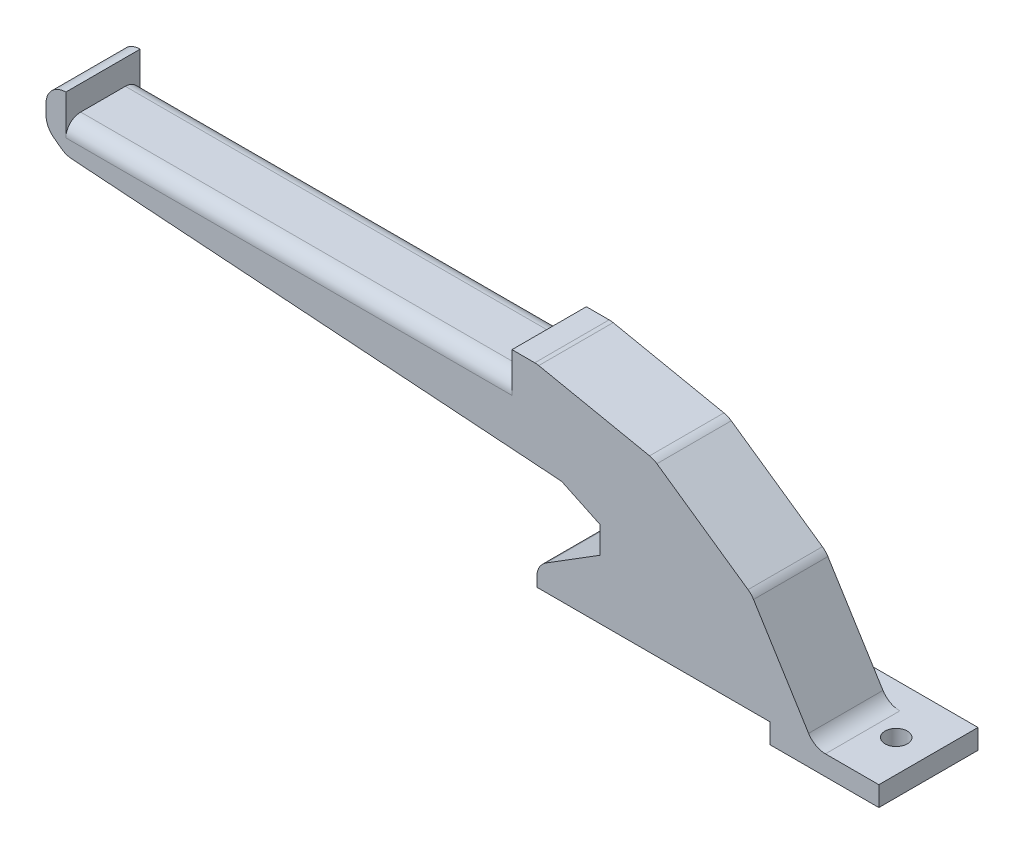
ISO-10303-21;
HEADER;
FILE_DESCRIPTION(('STEP AP214'),'2;1');
FILE_NAME('part.step','',(''),(''),'','','');
FILE_SCHEMA(('AUTOMOTIVE_DESIGN { 1 0 10303 214 1 1 1 1 }'));
ENDSEC;
DATA;
#1=APPLICATION_CONTEXT('core data for automotive mechanical design processes');
#2=APPLICATION_PROTOCOL_DEFINITION('international standard','automotive_design',2000,#1);
#3=PRODUCT_CONTEXT('',#1,'mechanical');
#4=PRODUCT('Part','Part','',(#3));
#5=PRODUCT_RELATED_PRODUCT_CATEGORY('part','',(#4));
#6=PRODUCT_DEFINITION_FORMATION('','',#4);
#7=PRODUCT_DEFINITION_CONTEXT('part definition',#1,'design');
#8=PRODUCT_DEFINITION('design','',#6,#7);
#9=PRODUCT_DEFINITION_SHAPE('','',#8);
#10=(LENGTH_UNIT() NAMED_UNIT(*) SI_UNIT(.MILLI.,.METRE.));
#11=(NAMED_UNIT(*) PLANE_ANGLE_UNIT() SI_UNIT($,.RADIAN.));
#12=(NAMED_UNIT(*) SI_UNIT($,.STERADIAN.) SOLID_ANGLE_UNIT());
#13=UNCERTAINTY_MEASURE_WITH_UNIT(LENGTH_MEASURE(1.E-05),#10,'distance_accuracy_value','');
#14=(GEOMETRIC_REPRESENTATION_CONTEXT(3) GLOBAL_UNCERTAINTY_ASSIGNED_CONTEXT((#13)) GLOBAL_UNIT_ASSIGNED_CONTEXT((#10,
#11,#12)) REPRESENTATION_CONTEXT('',''));
#15=CARTESIAN_POINT('',(0.,0.,0.));
#16=DIRECTION('',(0.,0.,1.));
#17=DIRECTION('',(1.,0.,0.));
#18=AXIS2_PLACEMENT_3D('',#15,#16,#17);
#19=CARTESIAN_POINT('',(0.,0.,0.));
#20=DIRECTION('',(0.,0.,1.));
#21=DIRECTION('',(1.,0.,0.));
#22=AXIS2_PLACEMENT_3D('',#19,#20,#21);
#23=PLANE('',#22);
#24=DIRECTION('',(1.,0.,0.));
#25=VECTOR('',#24,1.);
#26=CARTESIAN_POINT('',(0.,4.,0.));
#27=LINE('',#26,#25);
#28=CARTESIAN_POINT('',(-22.,4.,0.));
#29=VERTEX_POINT('',#28);
#30=CARTESIAN_POINT('',(-10.7786204532424,4.,0.));
#31=VERTEX_POINT('',#30);
#32=EDGE_CURVE('E254',#29,#31,#27,.T.);
#33=ORIENTED_EDGE('',*,*,#32,.F.);
#34=DIRECTION('',(1.,0.,0.));
#35=VECTOR('',#34,1.);
#36=CARTESIAN_POINT('',(-22.,4.,0.));
#37=LINE('',#36,#35);
#38=CARTESIAN_POINT('',(-69.,3.99999999999999,0.));
#39=VERTEX_POINT('',#38);
#40=EDGE_CURVE('E268',#39,#29,#37,.T.);
#41=ORIENTED_EDGE('',*,*,#40,.F.);
#42=DIRECTION('',(0.,-1.,0.));
#43=VECTOR('',#42,1.);
#44=CARTESIAN_POINT('',(-69.,3.99999999999999,0.));
#45=LINE('',#44,#43);
#46=CARTESIAN_POINT('',(-69.,5.78120293479995,0.));
#47=VERTEX_POINT('',#46);
#48=EDGE_CURVE('E335',#47,#39,#45,.T.);
#49=ORIENTED_EDGE('',*,*,#48,.F.);
#50=CARTESIAN_POINT('',(-65.,5.78120293479995,0.));
#51=DIRECTION('',(0.,0.,1.));
#52=DIRECTION('',(1.,0.,0.));
#53=AXIS2_PLACEMENT_3D('',#50,#51,#52);
#54=CIRCLE('',#53,4.);
#55=CARTESIAN_POINT('',(-67.117651885133,9.17465994696211,0.));
#56=VERTEX_POINT('',#55);
#57=EDGE_CURVE('E406',#47,#56,#54,.F.);
#58=ORIENTED_EDGE('',*,*,#57,.T.);
#59=DIRECTION('',(-0.84836425304054,-0.529412971283256,0.));
#60=VECTOR('',#59,1.);
#61=CARTESIAN_POINT('',(-56.2601669898461,15.9501615295379,0.));
#62=LINE('',#61,#60);
#63=CARTESIAN_POINT('',(-56.2601669898461,15.9501615295379,0.));
#64=VERTEX_POINT('',#63);
#65=EDGE_CURVE('E332',#64,#56,#62,.T.);
#66=ORIENTED_EDGE('',*,*,#65,.F.);
#67=DIRECTION('',(0.,-1.,0.));
#68=VECTOR('',#67,1.);
#69=CARTESIAN_POINT('',(-56.2601669898461,21.3381404500216,0.));
#70=LINE('',#69,#68);
#71=CARTESIAN_POINT('',(-56.2601669898461,21.3381404500216,0.));
#72=VERTEX_POINT('',#71);
#73=EDGE_CURVE('E330',#72,#64,#70,.T.);
#74=ORIENTED_EDGE('',*,*,#73,.F.);
#75=DIRECTION('',(0.90393551683164,-0.427668775351106,0.));
#76=VECTOR('',#75,1.);
#77=CARTESIAN_POINT('',(-64.,25.,0.));
#78=LINE('',#77,#76);
#79=CARTESIAN_POINT('',(-64.,25.,0.));
#80=VERTEX_POINT('',#79);
#81=EDGE_CURVE('E328',#80,#72,#78,.T.);
#82=ORIENTED_EDGE('',*,*,#81,.F.);
#83=DIRECTION('',(0.997558967141627,-0.0698291276999137,0.));
#84=VECTOR('',#83,1.);
#85=CARTESIAN_POINT('',(-164.,32.,0.));
#86=LINE('',#85,#84);
#87=CARTESIAN_POINT('',(-162.823122428921,31.9176185700244,0.));
#88=VERTEX_POINT('',#87);
#89=EDGE_CURVE('E326',#88,#80,#86,.T.);
#90=ORIENTED_EDGE('',*,*,#89,.F.);
#91=CARTESIAN_POINT('',(-162.543805918121,35.9078544385909,0.));
#92=DIRECTION('',(0.,0.,1.));
#93=DIRECTION('',(1.,0.,0.));
#94=AXIS2_PLACEMENT_3D('',#91,#92,#93);
#95=CIRCLE('',#94,4.);
#96=CARTESIAN_POINT('',(-164.943805918121,32.7078544385909,0.));
#97=VERTEX_POINT('',#96);
#98=EDGE_CURVE('E400',#88,#97,#95,.F.);
#99=ORIENTED_EDGE('',*,*,#98,.T.);
#100=DIRECTION('',(0.799999999999999,-0.600000000000001,0.));
#101=VECTOR('',#100,1.);
#102=CARTESIAN_POINT('',(-168.,35.,0.));
#103=LINE('',#102,#101);
#104=CARTESIAN_POINT('',(-166.4,33.8,0.));
#105=VERTEX_POINT('',#104);
#106=EDGE_CURVE('E323',#105,#97,#103,.T.);
#107=ORIENTED_EDGE('',*,*,#106,.F.);
#108=CARTESIAN_POINT('',(-164.,37.,0.));
#109=DIRECTION('',(0.,0.,1.));
#110=DIRECTION('',(1.,0.,0.));
#111=AXIS2_PLACEMENT_3D('',#108,#109,#110);
#112=CIRCLE('',#111,4.);
#113=CARTESIAN_POINT('',(-168.,37.,0.));
#114=VERTEX_POINT('',#113);
#115=EDGE_CURVE('E402',#105,#114,#112,.F.);
#116=ORIENTED_EDGE('',*,*,#115,.T.);
#117=DIRECTION('',(0.,-1.,0.));
#118=VECTOR('',#117,1.);
#119=CARTESIAN_POINT('',(-168.,43.,0.));
#120=LINE('',#119,#118);
#121=CARTESIAN_POINT('',(-168.,39.,0.));
#122=VERTEX_POINT('',#121);
#123=EDGE_CURVE('E320',#122,#114,#120,.T.);
#124=ORIENTED_EDGE('',*,*,#123,.F.);
#125=CARTESIAN_POINT('',(-164.,39.,0.));
#126=DIRECTION('',(0.,0.,1.));
#127=DIRECTION('',(1.,0.,0.));
#128=AXIS2_PLACEMENT_3D('',#125,#126,#127);
#129=CIRCLE('',#128,4.);
#130=CARTESIAN_POINT('',(-164.,43.,0.));
#131=VERTEX_POINT('',#130);
#132=EDGE_CURVE('E404',#122,#131,#129,.F.);
#133=ORIENTED_EDGE('',*,*,#132,.T.);
#134=DIRECTION('',(0.,1.,0.));
#135=VECTOR('',#134,1.);
#136=CARTESIAN_POINT('',(-164.,38.,0.));
#137=LINE('',#136,#135);
#138=CARTESIAN_POINT('',(-164.,35.,0.));
#139=VERTEX_POINT('',#138);
#140=EDGE_CURVE('E317',#139,#131,#137,.T.);
#141=ORIENTED_EDGE('',*,*,#140,.F.);
#142=DIRECTION('',(-1.,0.,0.));
#143=VECTOR('',#142,1.);
#144=CARTESIAN_POINT('',(0.,35.,0.));
#145=LINE('',#144,#143);
#146=CARTESIAN_POINT('',(-74.,35.,0.));
#147=VERTEX_POINT('',#146);
#148=EDGE_CURVE('E374',#139,#147,#145,.F.);
#149=ORIENTED_EDGE('',*,*,#148,.T.);
#150=DIRECTION('',(0.,-1.,0.));
#151=VECTOR('',#150,1.);
#152=CARTESIAN_POINT('',(-74.,43.,0.));
#153=LINE('',#152,#151);
#154=CARTESIAN_POINT('',(-74.,43.,0.));
#155=VERTEX_POINT('',#154);
#156=EDGE_CURVE('E315',#155,#147,#153,.T.);
#157=ORIENTED_EDGE('',*,*,#156,.F.);
#158=DIRECTION('',(-1.,0.,0.));
#159=VECTOR('',#158,1.);
#160=CARTESIAN_POINT('',(-69.,43.,0.));
#161=LINE('',#160,#159);
#162=CARTESIAN_POINT('',(-69.4069453503796,43.,0.));
#163=VERTEX_POINT('',#162);
#164=EDGE_CURVE('E313',#163,#155,#161,.T.);
#165=ORIENTED_EDGE('',*,*,#164,.F.);
#166=CARTESIAN_POINT('',(-69.4069453503796,39.,0.));
#167=DIRECTION('',(0.,0.,1.));
#168=DIRECTION('',(1.,0.,0.));
#169=AXIS2_PLACEMENT_3D('',#166,#167,#168);
#170=CIRCLE('',#169,4.);
#171=CARTESIAN_POINT('',(-68.6013923506455,42.9180459880685,0.));
#172=VERTEX_POINT('',#171);
#173=EDGE_CURVE('E412',#163,#172,#170,.F.);
#174=ORIENTED_EDGE('',*,*,#173,.T.);
#175=DIRECTION('',(-0.97951149701712,0.201388249933507,0.));
#176=VECTOR('',#175,1.);
#177=CARTESIAN_POINT('',(-45.4448813217322,38.1570510994119,0.));
#178=LINE('',#177,#176);
#179=CARTESIAN_POINT('',(-46.2504343214662,38.3226733604463,0.));
#180=VERTEX_POINT('',#179);
#181=EDGE_CURVE('E310',#180,#172,#178,.T.);
#182=ORIENTED_EDGE('',*,*,#181,.F.);
#183=CARTESIAN_POINT('',(-47.0559873212002,34.4046273723778,0.));
#184=DIRECTION('',(0.,0.,1.));
#185=DIRECTION('',(1.,0.,0.));
#186=AXIS2_PLACEMENT_3D('',#183,#184,#185);
#187=CIRCLE('',#186,4.);
#188=CARTESIAN_POINT('',(-44.7700123061619,37.6870530349969,0.));
#189=VERTEX_POINT('',#188);
#190=EDGE_CURVE('E410',#180,#189,#187,.F.);
#191=ORIENTED_EDGE('',*,*,#190,.T.);
#192=DIRECTION('',(-0.82060641565478,0.571493753759579,0.));
#193=VECTOR('',#192,1.);
#194=CARTESIAN_POINT('',(-25.7110838443571,24.4138707133829,0.));
#195=LINE('',#194,#193);
#196=CARTESIAN_POINT('',(-26.3859528599274,24.8838687777979,0.));
#197=VERTEX_POINT('',#196);
#198=EDGE_CURVE('E308',#197,#189,#195,.T.);
#199=ORIENTED_EDGE('',*,*,#198,.F.);
#200=CARTESIAN_POINT('',(-28.6719278749657,21.6014431151787,0.));
#201=DIRECTION('',(0.,0.,1.));
#202=DIRECTION('',(1.,0.,0.));
#203=AXIS2_PLACEMENT_3D('',#200,#201,#202);
#204=CIRCLE('',#203,4.);
#205=CARTESIAN_POINT('',(-25.27638207696,23.7157441187366,0.));
#206=VERTEX_POINT('',#205);
#207=EDGE_CURVE('E408',#197,#206,#204,.F.);
#208=ORIENTED_EDGE('',*,*,#207,.T.);
#209=DIRECTION('',(-0.528575250889458,0.848886449501432,0.));
#210=VECTOR('',#209,1.);
#211=CARTESIAN_POINT('',(-13.,4.,0.));
#212=LINE('',#211,#210);
#213=CARTESIAN_POINT('',(-14.1741662512481,5.88569899644217,0.));
#214=VERTEX_POINT('',#213);
#215=EDGE_CURVE('E265',#214,#206,#212,.T.);
#216=ORIENTED_EDGE('',*,*,#215,.F.);
#217=CARTESIAN_POINT('',(-10.7786204532424,8.,0.));
#218=DIRECTION('',(0.,0.,1.));
#219=DIRECTION('',(1.,0.,0.));
#220=AXIS2_PLACEMENT_3D('',#217,#218,#219);
#221=CIRCLE('',#220,4.);
#222=EDGE_CURVE('E41',#214,#31,#221,.T.);
#223=ORIENTED_EDGE('',*,*,#222,.T.);
#224=EDGE_LOOP('',(#33,#41,#49,#58,#66,#74,#82,#90,#99,#107,#116,#124,#133,#141,#149,#157,#165,
#174,#182,#191,#199,#208,#216,#223));
#225=FACE_BOUND('',#224,.T.);
#226=ADVANCED_FACE('F33',(#225),#23,.F.);
#227=CARTESIAN_POINT('',(0.,0.,15.));
#228=DIRECTION('',(-1.,0.,0.));
#229=DIRECTION('',(0.,0.,1.));
#230=AXIS2_PLACEMENT_3D('',#227,#228,#229);
#231=PLANE('',#230);
#232=DIRECTION('',(0.,0.,-1.));
#233=VECTOR('',#232,1.);
#234=CARTESIAN_POINT('',(0.,0.,15.));
#235=LINE('',#234,#233);
#236=CARTESIAN_POINT('',(0.,0.,15.));
#237=VERTEX_POINT('',#236);
#238=CARTESIAN_POINT('',(0.,0.,-5.));
#239=VERTEX_POINT('',#238);
#240=EDGE_CURVE('E229',#237,#239,#235,.T.);
#241=ORIENTED_EDGE('',*,*,#240,.T.);
#242=DIRECTION('',(0.,-1.,0.));
#243=VECTOR('',#242,1.);
#244=CARTESIAN_POINT('',(0.,4.,-5.));
#245=LINE('',#244,#243);
#246=CARTESIAN_POINT('',(0.,4.,-5.));
#247=VERTEX_POINT('',#246);
#248=EDGE_CURVE('E234',#247,#239,#245,.T.);
#249=ORIENTED_EDGE('',*,*,#248,.F.);
#250=DIRECTION('',(0.,0.,-1.));
#251=VECTOR('',#250,1.);
#252=CARTESIAN_POINT('',(0.,4.,15.));
#253=LINE('',#252,#251);
#254=CARTESIAN_POINT('',(0.,4.,15.));
#255=VERTEX_POINT('',#254);
#256=EDGE_CURVE('E367',#255,#247,#253,.T.);
#257=ORIENTED_EDGE('',*,*,#256,.F.);
#258=DIRECTION('',(0.,1.,0.));
#259=VECTOR('',#258,1.);
#260=CARTESIAN_POINT('',(0.,0.,15.));
#261=LINE('',#260,#259);
#262=EDGE_CURVE('E236',#237,#255,#261,.T.);
#263=ORIENTED_EDGE('',*,*,#262,.F.);
#264=EDGE_LOOP('',(#241,#249,#257,#263));
#265=FACE_BOUND('',#264,.T.);
#266=ADVANCED_FACE('F231',(#265),#231,.F.);
#267=CARTESIAN_POINT('',(0.,4.,15.));
#268=DIRECTION('',(0.,-1.,0.));
#269=DIRECTION('',(1.,0.,0.));
#270=AXIS2_PLACEMENT_3D('',#267,#268,#269);
#271=PLANE('',#270);
#272=CARTESIAN_POINT('',(-6.5,4.,5.));
#273=DIRECTION('',(0.,1.,0.));
#274=DIRECTION('',(0.,0.,1.));
#275=AXIS2_PLACEMENT_3D('',#272,#273,#274);
#276=CIRCLE('',#275,2.24999999999999);
#277=CARTESIAN_POINT('',(-6.5,4.,7.24999999999999));
#278=VERTEX_POINT('',#277);
#279=EDGE_CURVE('E850',#278,#278,#276,.T.);
#280=ORIENTED_EDGE('',*,*,#279,.F.);
#281=EDGE_LOOP('',(#280));
#282=FACE_BOUND('',#281,.T.);
#283=ORIENTED_EDGE('',*,*,#256,.T.);
#284=DIRECTION('',(1.,0.,0.));
#285=VECTOR('',#284,1.);
#286=CARTESIAN_POINT('',(0.,4.,-5.));
#287=LINE('',#286,#285);
#288=CARTESIAN_POINT('',(-22.,4.,-5.));
#289=VERTEX_POINT('',#288);
#290=EDGE_CURVE('E253',#289,#247,#287,.T.);
#291=ORIENTED_EDGE('',*,*,#290,.F.);
#292=DIRECTION('',(0.,0.,1.));
#293=VECTOR('',#292,1.);
#294=CARTESIAN_POINT('',(-22.,4.,-5.));
#295=LINE('',#294,#293);
#296=EDGE_CURVE('E262',#289,#29,#295,.T.);
#297=ORIENTED_EDGE('',*,*,#296,.T.);
#298=ORIENTED_EDGE('',*,*,#32,.T.);
#299=DIRECTION('',(0.,0.,-1.));
#300=VECTOR('',#299,1.);
#301=CARTESIAN_POINT('',(-10.7786204532424,4.,15.));
#302=LINE('',#301,#300);
#303=CARTESIAN_POINT('',(-10.7786204532424,4.,15.));
#304=VERTEX_POINT('',#303);
#305=EDGE_CURVE('E395',#31,#304,#302,.F.);
#306=ORIENTED_EDGE('',*,*,#305,.T.);
#307=DIRECTION('',(-1.,0.,0.));
#308=VECTOR('',#307,1.);
#309=CARTESIAN_POINT('',(0.,4.,15.));
#310=LINE('',#309,#308);
#311=EDGE_CURVE('E267',#255,#304,#310,.T.);
#312=ORIENTED_EDGE('',*,*,#311,.F.);
#313=EDGE_LOOP('',(#283,#291,#297,#298,#306,#312));
#314=FACE_BOUND('',#313,.T.);
#315=ADVANCED_FACE('F464',(#282,#314),#271,.F.);
#316=CARTESIAN_POINT('',(-13.,4.,15.));
#317=DIRECTION('',(-0.848886449501432,-0.528575250889458,0.));
#318=DIRECTION('',(0.528575250889458,-0.848886449501432,0.));
#319=AXIS2_PLACEMENT_3D('',#316,#317,#318);
#320=PLANE('',#319);
#321=DIRECTION('',(-0.528575250889458,0.848886449501432,0.));
#322=VECTOR('',#321,1.);
#323=CARTESIAN_POINT('',(-13.,4.,15.));
#324=LINE('',#323,#322);
#325=CARTESIAN_POINT('',(-14.1741662512481,5.88569899644217,15.));
#326=VERTEX_POINT('',#325);
#327=CARTESIAN_POINT('',(-25.27638207696,23.7157441187366,15.));
#328=VERTEX_POINT('',#327);
#329=EDGE_CURVE('E271',#326,#328,#324,.T.);
#330=ORIENTED_EDGE('',*,*,#329,.F.);
#331=DIRECTION('',(0.,0.,-1.));
#332=VECTOR('',#331,1.);
#333=CARTESIAN_POINT('',(-14.1741662512481,5.88569899644217,0.));
#334=LINE('',#333,#332);
#335=EDGE_CURVE('E392',#326,#214,#334,.T.);
#336=ORIENTED_EDGE('',*,*,#335,.T.);
#337=ORIENTED_EDGE('',*,*,#215,.T.);
#338=DIRECTION('',(0.,0.,-1.));
#339=VECTOR('',#338,1.);
#340=CARTESIAN_POINT('',(-25.27638207696,23.7157441187366,15.));
#341=LINE('',#340,#339);
#342=EDGE_CURVE('E390',#206,#328,#341,.F.);
#343=ORIENTED_EDGE('',*,*,#342,.T.);
#344=EDGE_LOOP('',(#330,#336,#337,#343));
#345=FACE_BOUND('',#344,.T.);
#346=ADVANCED_FACE('F564',(#345),#320,.F.);
#347=CARTESIAN_POINT('',(-25.7110838443571,24.4138707133829,15.));
#348=DIRECTION('',(-0.571493753759579,-0.82060641565478,0.));
#349=DIRECTION('',(0.82060641565478,-0.571493753759579,0.));
#350=AXIS2_PLACEMENT_3D('',#347,#348,#349);
#351=PLANE('',#350);
#352=ORIENTED_EDGE('',*,*,#198,.T.);
#353=DIRECTION('',(0.,0.,-1.));
#354=VECTOR('',#353,1.);
#355=CARTESIAN_POINT('',(-44.7700123061619,37.6870530349969,15.));
#356=LINE('',#355,#354);
#357=CARTESIAN_POINT('',(-44.7700123061619,37.6870530349969,15.));
#358=VERTEX_POINT('',#357);
#359=EDGE_CURVE('E48',#189,#358,#356,.F.);
#360=ORIENTED_EDGE('',*,*,#359,.T.);
#361=DIRECTION('',(-0.82060641565478,0.571493753759579,0.));
#362=VECTOR('',#361,1.);
#363=CARTESIAN_POINT('',(-25.7110838443571,24.4138707133829,15.));
#364=LINE('',#363,#362);
#365=CARTESIAN_POINT('',(-26.3859528599274,24.8838687777979,15.));
#366=VERTEX_POINT('',#365);
#367=EDGE_CURVE('E273',#366,#358,#364,.T.);
#368=ORIENTED_EDGE('',*,*,#367,.F.);
#369=DIRECTION('',(0.,0.,-1.));
#370=VECTOR('',#369,1.);
#371=CARTESIAN_POINT('',(-26.3859528599274,24.8838687777979,15.));
#372=LINE('',#371,#370);
#373=EDGE_CURVE('E432',#366,#197,#372,.T.);
#374=ORIENTED_EDGE('',*,*,#373,.T.);
#375=EDGE_LOOP('',(#352,#360,#368,#374));
#376=FACE_BOUND('',#375,.T.);
#377=ADVANCED_FACE('F558',(#376),#351,.F.);
#378=CARTESIAN_POINT('',(-45.4448813217322,38.1570510994119,15.));
#379=DIRECTION('',(-0.201388249933507,-0.97951149701712,0.));
#380=DIRECTION('',(0.97951149701712,-0.201388249933507,0.));
#381=AXIS2_PLACEMENT_3D('',#378,#379,#380);
#382=PLANE('',#381);
#383=ORIENTED_EDGE('',*,*,#181,.T.);
#384=DIRECTION('',(0.,0.,-1.));
#385=VECTOR('',#384,1.);
#386=CARTESIAN_POINT('',(-68.6013923506455,42.9180459880685,15.));
#387=LINE('',#386,#385);
#388=CARTESIAN_POINT('',(-68.6013923506455,42.9180459880685,15.));
#389=VERTEX_POINT('',#388);
#390=EDGE_CURVE('E417',#172,#389,#387,.F.);
#391=ORIENTED_EDGE('',*,*,#390,.T.);
#392=DIRECTION('',(-0.97951149701712,0.201388249933507,0.));
#393=VECTOR('',#392,1.);
#394=CARTESIAN_POINT('',(-45.4448813217322,38.1570510994119,15.));
#395=LINE('',#394,#393);
#396=CARTESIAN_POINT('',(-46.2504343214662,38.3226733604463,15.));
#397=VERTEX_POINT('',#396);
#398=EDGE_CURVE('E275',#397,#389,#395,.T.);
#399=ORIENTED_EDGE('',*,*,#398,.F.);
#400=DIRECTION('',(0.,0.,-1.));
#401=VECTOR('',#400,1.);
#402=CARTESIAN_POINT('',(-46.2504343214662,38.3226733604463,15.));
#403=LINE('',#402,#401);
#404=EDGE_CURVE('E414',#397,#180,#403,.T.);
#405=ORIENTED_EDGE('',*,*,#404,.T.);
#406=EDGE_LOOP('',(#383,#391,#399,#405));
#407=FACE_BOUND('',#406,.T.);
#408=ADVANCED_FACE('F551',(#407),#382,.F.);
#409=CARTESIAN_POINT('',(-69.,43.,15.));
#410=DIRECTION('',(0.,-1.,0.));
#411=DIRECTION('',(0.,0.,-1.));
#412=AXIS2_PLACEMENT_3D('',#409,#410,#411);
#413=PLANE('',#412);
#414=DIRECTION('',(-1.,0.,0.));
#415=VECTOR('',#414,1.);
#416=CARTESIAN_POINT('',(-69.,43.,15.));
#417=LINE('',#416,#415);
#418=CARTESIAN_POINT('',(-69.4069453503796,43.,15.));
#419=VERTEX_POINT('',#418);
#420=CARTESIAN_POINT('',(-74.,43.,15.));
#421=VERTEX_POINT('',#420);
#422=EDGE_CURVE('E278',#419,#421,#417,.T.);
#423=ORIENTED_EDGE('',*,*,#422,.F.);
#424=DIRECTION('',(0.,0.,-1.));
#425=VECTOR('',#424,1.);
#426=CARTESIAN_POINT('',(-69.4069453503796,43.,15.));
#427=LINE('',#426,#425);
#428=EDGE_CURVE('E397',#419,#163,#427,.T.);
#429=ORIENTED_EDGE('',*,*,#428,.T.);
#430=ORIENTED_EDGE('',*,*,#164,.T.);
#431=DIRECTION('',(0.,0.,-1.));
#432=VECTOR('',#431,1.);
#433=CARTESIAN_POINT('',(-74.,43.,15.));
#434=LINE('',#433,#432);
#435=EDGE_CURVE('E364',#421,#155,#434,.T.);
#436=ORIENTED_EDGE('',*,*,#435,.F.);
#437=EDGE_LOOP('',(#423,#429,#430,#436));
#438=FACE_BOUND('',#437,.T.);
#439=ADVANCED_FACE('F543',(#438),#413,.F.);
#440=CARTESIAN_POINT('',(-74.,43.,15.));
#441=DIRECTION('',(1.,0.,0.));
#442=DIRECTION('',(0.,0.,-1.));
#443=AXIS2_PLACEMENT_3D('',#440,#441,#442);
#444=PLANE('',#443);
#445=ORIENTED_EDGE('',*,*,#156,.T.);
#446=CARTESIAN_POINT('',(-74.,35.,3.));
#447=DIRECTION('',(1.,0.,0.));
#448=DIRECTION('',(0.,0.,-1.));
#449=AXIS2_PLACEMENT_3D('',#446,#447,#448);
#450=CIRCLE('',#449,3.);
#451=CARTESIAN_POINT('',(-74.,38.,3.));
#452=VERTEX_POINT('',#451);
#453=EDGE_CURVE('E383',#147,#452,#450,.T.);
#454=ORIENTED_EDGE('',*,*,#453,.T.);
#455=DIRECTION('',(0.,0.,-1.));
#456=VECTOR('',#455,1.);
#457=CARTESIAN_POINT('',(-74.,38.,15.));
#458=LINE('',#457,#456);
#459=CARTESIAN_POINT('',(-74.,38.,12.));
#460=VERTEX_POINT('',#459);
#461=EDGE_CURVE('E361',#460,#452,#458,.T.);
#462=ORIENTED_EDGE('',*,*,#461,.F.);
#463=CARTESIAN_POINT('',(-74.,35.,12.));
#464=DIRECTION('',(1.,0.,0.));
#465=DIRECTION('',(0.,0.,-1.));
#466=AXIS2_PLACEMENT_3D('',#463,#464,#465);
#467=CIRCLE('',#466,3.);
#468=CARTESIAN_POINT('',(-74.,35.,15.));
#469=VERTEX_POINT('',#468);
#470=EDGE_CURVE('E387',#460,#469,#467,.T.);
#471=ORIENTED_EDGE('',*,*,#470,.T.);
#472=DIRECTION('',(0.,-1.,0.));
#473=VECTOR('',#472,1.);
#474=CARTESIAN_POINT('',(-74.,43.,15.));
#475=LINE('',#474,#473);
#476=EDGE_CURVE('E280',#421,#469,#475,.T.);
#477=ORIENTED_EDGE('',*,*,#476,.F.);
#478=ORIENTED_EDGE('',*,*,#435,.T.);
#479=EDGE_LOOP('',(#445,#454,#462,#471,#477,#478));
#480=FACE_BOUND('',#479,.T.);
#481=ADVANCED_FACE('F537',(#480),#444,.F.);
#482=CARTESIAN_POINT('',(-74.,38.,15.));
#483=DIRECTION('',(0.,-1.,0.));
#484=DIRECTION('',(1.,0.,0.));
#485=AXIS2_PLACEMENT_3D('',#482,#483,#484);
#486=PLANE('',#485);
#487=ORIENTED_EDGE('',*,*,#461,.T.);
#488=DIRECTION('',(-1.,0.,0.));
#489=VECTOR('',#488,1.);
#490=CARTESIAN_POINT('',(-74.,38.,3.));
#491=LINE('',#490,#489);
#492=CARTESIAN_POINT('',(-164.,38.,3.));
#493=VERTEX_POINT('',#492);
#494=EDGE_CURVE('E371',#452,#493,#491,.T.);
#495=ORIENTED_EDGE('',*,*,#494,.T.);
#496=DIRECTION('',(0.,0.,-1.));
#497=VECTOR('',#496,1.);
#498=CARTESIAN_POINT('',(-164.,38.,15.));
#499=LINE('',#498,#497);
#500=CARTESIAN_POINT('',(-164.,38.,12.));
#501=VERTEX_POINT('',#500);
#502=EDGE_CURVE('E358',#501,#493,#499,.T.);
#503=ORIENTED_EDGE('',*,*,#502,.F.);
#504=DIRECTION('',(-1.,0.,0.));
#505=VECTOR('',#504,1.);
#506=CARTESIAN_POINT('',(-74.,38.,12.));
#507=LINE('',#506,#505);
#508=EDGE_CURVE('E369',#501,#460,#507,.F.);
#509=ORIENTED_EDGE('',*,*,#508,.T.);
#510=EDGE_LOOP('',(#487,#495,#503,#509));
#511=FACE_BOUND('',#510,.T.);
#512=ADVANCED_FACE('F606',(#511),#486,.F.);
#513=CARTESIAN_POINT('',(-164.,38.,15.));
#514=DIRECTION('',(-1.,0.,0.));
#515=DIRECTION('',(0.,0.,1.));
#516=AXIS2_PLACEMENT_3D('',#513,#514,#515);
#517=PLANE('',#516);
#518=ORIENTED_EDGE('',*,*,#140,.T.);
#519=DIRECTION('',(0.,0.,-1.));
#520=VECTOR('',#519,1.);
#521=CARTESIAN_POINT('',(-164.,43.,15.));
#522=LINE('',#521,#520);
#523=CARTESIAN_POINT('',(-164.,43.,15.));
#524=VERTEX_POINT('',#523);
#525=EDGE_CURVE('E355',#524,#131,#522,.T.);
#526=ORIENTED_EDGE('',*,*,#525,.F.);
#527=DIRECTION('',(0.,1.,0.));
#528=VECTOR('',#527,1.);
#529=CARTESIAN_POINT('',(-164.,38.,15.));
#530=LINE('',#529,#528);
#531=CARTESIAN_POINT('',(-164.,35.,15.));
#532=VERTEX_POINT('',#531);
#533=EDGE_CURVE('E282',#532,#524,#530,.T.);
#534=ORIENTED_EDGE('',*,*,#533,.F.);
#535=CARTESIAN_POINT('',(-164.,35.,12.));
#536=DIRECTION('',(-1.,0.,0.));
#537=DIRECTION('',(0.,0.,1.));
#538=AXIS2_PLACEMENT_3D('',#535,#536,#537);
#539=CIRCLE('',#538,3.);
#540=EDGE_CURVE('E385',#532,#501,#539,.T.);
#541=ORIENTED_EDGE('',*,*,#540,.T.);
#542=ORIENTED_EDGE('',*,*,#502,.T.);
#543=CARTESIAN_POINT('',(-164.,35.,3.));
#544=DIRECTION('',(-1.,0.,0.));
#545=DIRECTION('',(0.,0.,1.));
#546=AXIS2_PLACEMENT_3D('',#543,#544,#545);
#547=CIRCLE('',#546,3.);
#548=EDGE_CURVE('E380',#493,#139,#547,.T.);
#549=ORIENTED_EDGE('',*,*,#548,.T.);
#550=EDGE_LOOP('',(#518,#526,#534,#541,#542,#549));
#551=FACE_BOUND('',#550,.T.);
#552=ADVANCED_FACE('F527',(#551),#517,.F.);
#553=CARTESIAN_POINT('',(-168.,43.,15.));
#554=DIRECTION('',(1.,0.,0.));
#555=DIRECTION('',(0.,0.,-1.));
#556=AXIS2_PLACEMENT_3D('',#553,#554,#555);
#557=PLANE('',#556);
#558=DIRECTION('',(0.,-1.,0.));
#559=VECTOR('',#558,1.);
#560=CARTESIAN_POINT('',(-168.,43.,15.));
#561=LINE('',#560,#559);
#562=CARTESIAN_POINT('',(-168.,39.,15.));
#563=VERTEX_POINT('',#562);
#564=CARTESIAN_POINT('',(-168.,37.,15.));
#565=VERTEX_POINT('',#564);
#566=EDGE_CURVE('E284',#563,#565,#561,.T.);
#567=ORIENTED_EDGE('',*,*,#566,.F.);
#568=DIRECTION('',(0.,0.,-1.));
#569=VECTOR('',#568,1.);
#570=CARTESIAN_POINT('',(-168.,39.,15.));
#571=LINE('',#570,#569);
#572=EDGE_CURVE('E443',#563,#122,#571,.T.);
#573=ORIENTED_EDGE('',*,*,#572,.T.);
#574=ORIENTED_EDGE('',*,*,#123,.T.);
#575=DIRECTION('',(0.,0.,-1.));
#576=VECTOR('',#575,1.);
#577=CARTESIAN_POINT('',(-168.,37.,15.));
#578=LINE('',#577,#576);
#579=EDGE_CURVE('E441',#114,#565,#578,.F.);
#580=ORIENTED_EDGE('',*,*,#579,.T.);
#581=EDGE_LOOP('',(#567,#573,#574,#580));
#582=FACE_BOUND('',#581,.T.);
#583=ADVANCED_FACE('F520',(#582),#557,.F.);
#584=CARTESIAN_POINT('',(-168.,35.,15.));
#585=DIRECTION('',(0.600000000000001,0.799999999999999,0.));
#586=DIRECTION('',(-0.799999999999999,0.600000000000001,0.));
#587=AXIS2_PLACEMENT_3D('',#584,#585,#586);
#588=PLANE('',#587);
#589=DIRECTION('',(0.799999999999999,-0.600000000000001,0.));
#590=VECTOR('',#589,1.);
#591=CARTESIAN_POINT('',(-168.,35.,15.));
#592=LINE('',#591,#590);
#593=CARTESIAN_POINT('',(-166.4,33.8,15.));
#594=VERTEX_POINT('',#593);
#595=CARTESIAN_POINT('',(-164.943805918121,32.7078544385909,15.));
#596=VERTEX_POINT('',#595);
#597=EDGE_CURVE('E287',#594,#596,#592,.T.);
#598=ORIENTED_EDGE('',*,*,#597,.F.);
#599=DIRECTION('',(0.,0.,-1.));
#600=VECTOR('',#599,1.);
#601=CARTESIAN_POINT('',(-166.4,33.8,15.));
#602=LINE('',#601,#600);
#603=EDGE_CURVE('E448',#594,#105,#602,.T.);
#604=ORIENTED_EDGE('',*,*,#603,.T.);
#605=ORIENTED_EDGE('',*,*,#106,.T.);
#606=DIRECTION('',(0.,0.,-1.));
#607=VECTOR('',#606,1.);
#608=CARTESIAN_POINT('',(-164.943805918121,32.7078544385909,15.));
#609=LINE('',#608,#607);
#610=EDGE_CURVE('E446',#97,#596,#609,.F.);
#611=ORIENTED_EDGE('',*,*,#610,.T.);
#612=EDGE_LOOP('',(#598,#604,#605,#611));
#613=FACE_BOUND('',#612,.T.);
#614=ADVANCED_FACE('F511',(#613),#588,.F.);
#615=CARTESIAN_POINT('',(-164.,32.,15.));
#616=DIRECTION('',(0.0698291276999137,0.997558967141627,0.));
#617=DIRECTION('',(-0.997558967141627,0.0698291276999137,0.));
#618=AXIS2_PLACEMENT_3D('',#615,#616,#617);
#619=PLANE('',#618);
#620=DIRECTION('',(0.997558967141627,-0.0698291276999137,0.));
#621=VECTOR('',#620,1.);
#622=CARTESIAN_POINT('',(-164.,32.,15.));
#623=LINE('',#622,#621);
#624=CARTESIAN_POINT('',(-162.823122428921,31.9176185700244,15.));
#625=VERTEX_POINT('',#624);
#626=CARTESIAN_POINT('',(-64.,25.,15.));
#627=VERTEX_POINT('',#626);
#628=EDGE_CURVE('E290',#625,#627,#623,.T.);
#629=ORIENTED_EDGE('',*,*,#628,.F.);
#630=DIRECTION('',(0.,0.,-1.));
#631=VECTOR('',#630,1.);
#632=CARTESIAN_POINT('',(-162.823122428921,31.9176185700244,15.));
#633=LINE('',#632,#631);
#634=EDGE_CURVE('E451',#625,#88,#633,.T.);
#635=ORIENTED_EDGE('',*,*,#634,.T.);
#636=ORIENTED_EDGE('',*,*,#89,.T.);
#637=DIRECTION('',(0.,0.,-1.));
#638=VECTOR('',#637,1.);
#639=CARTESIAN_POINT('',(-64.,25.,15.));
#640=LINE('',#639,#638);
#641=EDGE_CURVE('E352',#627,#80,#640,.T.);
#642=ORIENTED_EDGE('',*,*,#641,.F.);
#643=EDGE_LOOP('',(#629,#635,#636,#642));
#644=FACE_BOUND('',#643,.T.);
#645=ADVANCED_FACE('F503',(#644),#619,.F.);
#646=CARTESIAN_POINT('',(-64.,25.,15.));
#647=DIRECTION('',(0.427668775351106,0.90393551683164,0.));
#648=DIRECTION('',(-0.903935516831641,0.427668775351106,0.));
#649=AXIS2_PLACEMENT_3D('',#646,#647,#648);
#650=PLANE('',#649);
#651=ORIENTED_EDGE('',*,*,#81,.T.);
#652=DIRECTION('',(0.,0.,-1.));
#653=VECTOR('',#652,1.);
#654=CARTESIAN_POINT('',(-56.2601669898461,21.3381404500216,15.));
#655=LINE('',#654,#653);
#656=CARTESIAN_POINT('',(-56.2601669898461,21.3381404500216,15.));
#657=VERTEX_POINT('',#656);
#658=EDGE_CURVE('E349',#657,#72,#655,.T.);
#659=ORIENTED_EDGE('',*,*,#658,.F.);
#660=DIRECTION('',(0.90393551683164,-0.427668775351106,0.));
#661=VECTOR('',#660,1.);
#662=CARTESIAN_POINT('',(-64.,25.,15.));
#663=LINE('',#662,#661);
#664=EDGE_CURVE('E292',#627,#657,#663,.T.);
#665=ORIENTED_EDGE('',*,*,#664,.F.);
#666=ORIENTED_EDGE('',*,*,#641,.T.);
#667=EDGE_LOOP('',(#651,#659,#665,#666));
#668=FACE_BOUND('',#667,.T.);
#669=ADVANCED_FACE('F499',(#668),#650,.F.);
#670=CARTESIAN_POINT('',(-56.2601669898461,21.3381404500216,15.));
#671=DIRECTION('',(1.,0.,0.));
#672=DIRECTION('',(0.,0.,-1.));
#673=AXIS2_PLACEMENT_3D('',#670,#671,#672);
#674=PLANE('',#673);
#675=ORIENTED_EDGE('',*,*,#73,.T.);
#676=DIRECTION('',(0.,0.,-1.));
#677=VECTOR('',#676,1.);
#678=CARTESIAN_POINT('',(-56.2601669898461,15.9501615295379,15.));
#679=LINE('',#678,#677);
#680=CARTESIAN_POINT('',(-56.2601669898461,15.9501615295379,15.));
#681=VERTEX_POINT('',#680);
#682=EDGE_CURVE('E346',#681,#64,#679,.T.);
#683=ORIENTED_EDGE('',*,*,#682,.F.);
#684=DIRECTION('',(0.,-1.,0.));
#685=VECTOR('',#684,1.);
#686=CARTESIAN_POINT('',(-56.2601669898461,21.3381404500216,15.));
#687=LINE('',#686,#685);
#688=EDGE_CURVE('E294',#657,#681,#687,.T.);
#689=ORIENTED_EDGE('',*,*,#688,.F.);
#690=ORIENTED_EDGE('',*,*,#658,.T.);
#691=EDGE_LOOP('',(#675,#683,#689,#690));
#692=FACE_BOUND('',#691,.T.);
#693=ADVANCED_FACE('F494',(#692),#674,.F.);
#694=CARTESIAN_POINT('',(-56.2601669898461,15.9501615295379,15.));
#695=DIRECTION('',(0.529412971283256,-0.848364253040541,0.));
#696=DIRECTION('',(0.848364253040541,0.529412971283256,0.));
#697=AXIS2_PLACEMENT_3D('',#694,#695,#696);
#698=PLANE('',#697);
#699=ORIENTED_EDGE('',*,*,#65,.T.);
#700=DIRECTION('',(0.,0.,-1.));
#701=VECTOR('',#700,1.);
#702=CARTESIAN_POINT('',(-67.117651885133,9.17465994696212,15.));
#703=LINE('',#702,#701);
#704=CARTESIAN_POINT('',(-67.117651885133,9.17465994696211,15.));
#705=VERTEX_POINT('',#704);
#706=EDGE_CURVE('E439',#56,#705,#703,.F.);
#707=ORIENTED_EDGE('',*,*,#706,.T.);
#708=DIRECTION('',(-0.84836425304054,-0.529412971283256,0.));
#709=VECTOR('',#708,1.);
#710=CARTESIAN_POINT('',(-56.2601669898461,15.9501615295379,15.));
#711=LINE('',#710,#709);
#712=EDGE_CURVE('E296',#681,#705,#711,.T.);
#713=ORIENTED_EDGE('',*,*,#712,.F.);
#714=ORIENTED_EDGE('',*,*,#682,.T.);
#715=EDGE_LOOP('',(#699,#707,#713,#714));
#716=FACE_BOUND('',#715,.T.);
#717=ADVANCED_FACE('F488',(#716),#698,.F.);
#718=CARTESIAN_POINT('',(-69.,3.99999999999999,15.));
#719=DIRECTION('',(1.,0.,0.));
#720=DIRECTION('',(0.,0.,-1.));
#721=AXIS2_PLACEMENT_3D('',#718,#719,#720);
#722=PLANE('',#721);
#723=DIRECTION('',(0.,-1.,0.));
#724=VECTOR('',#723,1.);
#725=CARTESIAN_POINT('',(-69.,3.99999999999999,15.));
#726=LINE('',#725,#724);
#727=CARTESIAN_POINT('',(-69.,5.78120293479995,15.));
#728=VERTEX_POINT('',#727);
#729=CARTESIAN_POINT('',(-69.,3.99999999999999,15.));
#730=VERTEX_POINT('',#729);
#731=EDGE_CURVE('E299',#728,#730,#726,.T.);
#732=ORIENTED_EDGE('',*,*,#731,.F.);
#733=DIRECTION('',(0.,0.,-1.));
#734=VECTOR('',#733,1.);
#735=CARTESIAN_POINT('',(-69.,5.78120293479995,15.));
#736=LINE('',#735,#734);
#737=EDGE_CURVE('E436',#728,#47,#736,.T.);
#738=ORIENTED_EDGE('',*,*,#737,.T.);
#739=ORIENTED_EDGE('',*,*,#48,.T.);
#740=DIRECTION('',(0.,0.,-1.));
#741=VECTOR('',#740,1.);
#742=CARTESIAN_POINT('',(-69.,3.99999999999999,15.));
#743=LINE('',#742,#741);
#744=EDGE_CURVE('E343',#730,#39,#743,.T.);
#745=ORIENTED_EDGE('',*,*,#744,.F.);
#746=EDGE_LOOP('',(#732,#738,#739,#745));
#747=FACE_BOUND('',#746,.T.);
#748=ADVANCED_FACE('F480',(#747),#722,.F.);
#749=CARTESIAN_POINT('',(-22.,4.,15.));
#750=DIRECTION('',(0.,1.,0.));
#751=DIRECTION('',(-1.,0.,0.));
#752=AXIS2_PLACEMENT_3D('',#749,#750,#751);
#753=PLANE('',#752);
#754=ORIENTED_EDGE('',*,*,#40,.T.);
#755=DIRECTION('',(0.,0.,-1.));
#756=VECTOR('',#755,1.);
#757=CARTESIAN_POINT('',(-22.,4.,15.));
#758=LINE('',#757,#756);
#759=CARTESIAN_POINT('',(-22.,4.,15.));
#760=VERTEX_POINT('',#759);
#761=EDGE_CURVE('E340',#760,#29,#758,.T.);
#762=ORIENTED_EDGE('',*,*,#761,.F.);
#763=DIRECTION('',(1.,0.,0.));
#764=VECTOR('',#763,1.);
#765=CARTESIAN_POINT('',(-22.,4.,15.));
#766=LINE('',#765,#764);
#767=EDGE_CURVE('E301',#730,#760,#766,.T.);
#768=ORIENTED_EDGE('',*,*,#767,.F.);
#769=ORIENTED_EDGE('',*,*,#744,.T.);
#770=EDGE_LOOP('',(#754,#762,#768,#769));
#771=FACE_BOUND('',#770,.T.);
#772=ADVANCED_FACE('F474',(#771),#753,.F.);
#773=CARTESIAN_POINT('',(-22.,0.,15.));
#774=DIRECTION('',(1.,0.,0.));
#775=DIRECTION('',(0.,0.,-1.));
#776=AXIS2_PLACEMENT_3D('',#773,#774,#775);
#777=PLANE('',#776);
#778=ORIENTED_EDGE('',*,*,#761,.T.);
#779=ORIENTED_EDGE('',*,*,#296,.F.);
#780=DIRECTION('',(0.,1.,0.));
#781=VECTOR('',#780,1.);
#782=CARTESIAN_POINT('',(-22.,4.,-5.));
#783=LINE('',#782,#781);
#784=CARTESIAN_POINT('',(-22.,0.,-5.));
#785=VERTEX_POINT('',#784);
#786=EDGE_CURVE('E248',#785,#289,#783,.T.);
#787=ORIENTED_EDGE('',*,*,#786,.F.);
#788=DIRECTION('',(0.,0.,-1.));
#789=VECTOR('',#788,1.);
#790=CARTESIAN_POINT('',(-22.,0.,15.));
#791=LINE('',#790,#789);
#792=CARTESIAN_POINT('',(-22.,0.,15.));
#793=VERTEX_POINT('',#792);
#794=EDGE_CURVE('E239',#793,#785,#791,.T.);
#795=ORIENTED_EDGE('',*,*,#794,.F.);
#796=DIRECTION('',(0.,-1.,0.));
#797=VECTOR('',#796,1.);
#798=CARTESIAN_POINT('',(-22.,0.,15.));
#799=LINE('',#798,#797);
#800=EDGE_CURVE('E303',#760,#793,#799,.T.);
#801=ORIENTED_EDGE('',*,*,#800,.F.);
#802=EDGE_LOOP('',(#778,#779,#787,#795,#801));
#803=FACE_BOUND('',#802,.T.);
#804=ADVANCED_FACE('F469',(#803),#777,.F.);
#805=CARTESIAN_POINT('',(0.,0.,15.));
#806=DIRECTION('',(0.,1.,0.));
#807=DIRECTION('',(-1.,0.,0.));
#808=AXIS2_PLACEMENT_3D('',#805,#806,#807);
#809=PLANE('',#808);
#810=CARTESIAN_POINT('',(-6.5,0.,5.));
#811=DIRECTION('',(0.,1.,0.));
#812=DIRECTION('',(-1.,0.,0.));
#813=AXIS2_PLACEMENT_3D('',#810,#811,#812);
#814=CIRCLE('',#813,2.24999999999999);
#815=CARTESIAN_POINT('',(-8.74999999999999,0.,5.));
#816=VERTEX_POINT('',#815);
#817=EDGE_CURVE('E256',#816,#816,#814,.T.);
#818=ORIENTED_EDGE('',*,*,#817,.T.);
#819=EDGE_LOOP('',(#818));
#820=FACE_BOUND('',#819,.T.);
#821=ORIENTED_EDGE('',*,*,#794,.T.);
#822=DIRECTION('',(-1.,0.,0.));
#823=VECTOR('',#822,1.);
#824=CARTESIAN_POINT('',(0.,0.,-5.));
#825=LINE('',#824,#823);
#826=EDGE_CURVE('E243',#239,#785,#825,.T.);
#827=ORIENTED_EDGE('',*,*,#826,.F.);
#828=ORIENTED_EDGE('',*,*,#240,.F.);
#829=DIRECTION('',(1.,0.,0.));
#830=VECTOR('',#829,1.);
#831=CARTESIAN_POINT('',(0.,0.,15.));
#832=LINE('',#831,#830);
#833=EDGE_CURVE('E240',#793,#237,#832,.T.);
#834=ORIENTED_EDGE('',*,*,#833,.F.);
#835=EDGE_LOOP('',(#821,#827,#828,#834));
#836=FACE_BOUND('',#835,.T.);
#837=ADVANCED_FACE('F244',(#820,#836),#809,.F.);
#838=CARTESIAN_POINT('',(0.,0.,15.));
#839=DIRECTION('',(0.,0.,1.));
#840=DIRECTION('',(1.,0.,0.));
#841=AXIS2_PLACEMENT_3D('',#838,#839,#840);
#842=PLANE('',#841);
#843=ORIENTED_EDGE('',*,*,#398,.T.);
#844=CARTESIAN_POINT('',(-69.4069453503796,39.,15.));
#845=DIRECTION('',(0.,0.,1.));
#846=DIRECTION('',(1.,0.,0.));
#847=AXIS2_PLACEMENT_3D('',#844,#845,#846);
#848=CIRCLE('',#847,4.);
#849=EDGE_CURVE('E430',#389,#419,#848,.T.);
#850=ORIENTED_EDGE('',*,*,#849,.T.);
#851=ORIENTED_EDGE('',*,*,#422,.T.);
#852=ORIENTED_EDGE('',*,*,#476,.T.);
#853=DIRECTION('',(-1.,0.,0.));
#854=VECTOR('',#853,1.);
#855=CARTESIAN_POINT('',(-164.,35.,15.));
#856=LINE('',#855,#854);
#857=EDGE_CURVE('E377',#469,#532,#856,.T.);
#858=ORIENTED_EDGE('',*,*,#857,.T.);
#859=ORIENTED_EDGE('',*,*,#533,.T.);
#860=CARTESIAN_POINT('',(-164.,39.,15.));
#861=DIRECTION('',(0.,0.,1.));
#862=DIRECTION('',(1.,0.,0.));
#863=AXIS2_PLACEMENT_3D('',#860,#861,#862);
#864=CIRCLE('',#863,4.);
#865=EDGE_CURVE('E423',#524,#563,#864,.T.);
#866=ORIENTED_EDGE('',*,*,#865,.T.);
#867=ORIENTED_EDGE('',*,*,#566,.T.);
#868=CARTESIAN_POINT('',(-164.,37.,15.));
#869=DIRECTION('',(0.,0.,1.));
#870=DIRECTION('',(1.,0.,0.));
#871=AXIS2_PLACEMENT_3D('',#868,#869,#870);
#872=CIRCLE('',#871,4.);
#873=EDGE_CURVE('E421',#565,#594,#872,.T.);
#874=ORIENTED_EDGE('',*,*,#873,.T.);
#875=ORIENTED_EDGE('',*,*,#597,.T.);
#876=CARTESIAN_POINT('',(-162.543805918121,35.9078544385909,15.));
#877=DIRECTION('',(0.,0.,1.));
#878=DIRECTION('',(1.,0.,0.));
#879=AXIS2_PLACEMENT_3D('',#876,#877,#878);
#880=CIRCLE('',#879,4.);
#881=EDGE_CURVE('E419',#596,#625,#880,.T.);
#882=ORIENTED_EDGE('',*,*,#881,.T.);
#883=ORIENTED_EDGE('',*,*,#628,.T.);
#884=ORIENTED_EDGE('',*,*,#664,.T.);
#885=ORIENTED_EDGE('',*,*,#688,.T.);
#886=ORIENTED_EDGE('',*,*,#712,.T.);
#887=CARTESIAN_POINT('',(-65.,5.78120293479995,15.));
#888=DIRECTION('',(0.,0.,1.));
#889=DIRECTION('',(1.,0.,0.));
#890=AXIS2_PLACEMENT_3D('',#887,#888,#889);
#891=CIRCLE('',#890,4.);
#892=EDGE_CURVE('E425',#705,#728,#891,.T.);
#893=ORIENTED_EDGE('',*,*,#892,.T.);
#894=ORIENTED_EDGE('',*,*,#731,.T.);
#895=ORIENTED_EDGE('',*,*,#767,.T.);
#896=ORIENTED_EDGE('',*,*,#800,.T.);
#897=ORIENTED_EDGE('',*,*,#833,.T.);
#898=ORIENTED_EDGE('',*,*,#262,.T.);
#899=ORIENTED_EDGE('',*,*,#311,.T.);
#900=CARTESIAN_POINT('',(-10.7786204532424,8.,15.));
#901=DIRECTION('',(0.,0.,1.));
#902=DIRECTION('',(1.,0.,0.));
#903=AXIS2_PLACEMENT_3D('',#900,#901,#902);
#904=CIRCLE('',#903,4.);
#905=EDGE_CURVE('E11',#304,#326,#904,.F.);
#906=ORIENTED_EDGE('',*,*,#905,.T.);
#907=ORIENTED_EDGE('',*,*,#329,.T.);
#908=CARTESIAN_POINT('',(-28.6719278749657,21.6014431151787,15.));
#909=DIRECTION('',(0.,0.,1.));
#910=DIRECTION('',(1.,0.,0.));
#911=AXIS2_PLACEMENT_3D('',#908,#909,#910);
#912=CIRCLE('',#911,4.);
#913=EDGE_CURVE('E55',#328,#366,#912,.T.);
#914=ORIENTED_EDGE('',*,*,#913,.T.);
#915=ORIENTED_EDGE('',*,*,#367,.T.);
#916=CARTESIAN_POINT('',(-47.0559873212002,34.4046273723778,15.));
#917=DIRECTION('',(0.,0.,1.));
#918=DIRECTION('',(1.,0.,0.));
#919=AXIS2_PLACEMENT_3D('',#916,#917,#918);
#920=CIRCLE('',#919,4.);
#921=EDGE_CURVE('E428',#358,#397,#920,.T.);
#922=ORIENTED_EDGE('',*,*,#921,.T.);
#923=EDGE_LOOP('',(#843,#850,#851,#852,#858,#859,#866,#867,#874,#875,#882,#883,#884,#885,#886,
#893,#894,#895,#896,#897,#898,#899,#906,#907,#914,#915,#922));
#924=FACE_BOUND('',#923,.T.);
#925=ADVANCED_FACE('F465',(#924),#842,.T.);
#926=CARTESIAN_POINT('',(-74.,35.,3.));
#927=DIRECTION('',(-1.,0.,0.));
#928=DIRECTION('',(0.,-1.,0.));
#929=AXIS2_PLACEMENT_3D('',#926,#927,#928);
#930=CYLINDRICAL_SURFACE('',#929,3.);
#931=ORIENTED_EDGE('',*,*,#453,.F.);
#932=ORIENTED_EDGE('',*,*,#148,.F.);
#933=ORIENTED_EDGE('',*,*,#548,.F.);
#934=ORIENTED_EDGE('',*,*,#494,.F.);
#935=EDGE_LOOP('',(#931,#932,#933,#934));
#936=FACE_BOUND('',#935,.T.);
#937=ADVANCED_FACE('F533',(#936),#930,.T.);
#938=CARTESIAN_POINT('',(0.,35.,12.));
#939=DIRECTION('',(1.,0.,0.));
#940=DIRECTION('',(0.,1.,0.));
#941=AXIS2_PLACEMENT_3D('',#938,#939,#940);
#942=CYLINDRICAL_SURFACE('',#941,3.);
#943=ORIENTED_EDGE('',*,*,#470,.F.);
#944=ORIENTED_EDGE('',*,*,#508,.F.);
#945=ORIENTED_EDGE('',*,*,#540,.F.);
#946=ORIENTED_EDGE('',*,*,#857,.F.);
#947=EDGE_LOOP('',(#943,#944,#945,#946));
#948=FACE_BOUND('',#947,.T.);
#949=ADVANCED_FACE('F691',(#948),#942,.T.);
#950=CARTESIAN_POINT('',(-10.7786204532424,8.,15.));
#951=DIRECTION('',(0.,0.,1.));
#952=DIRECTION('',(1.,0.,0.));
#953=AXIS2_PLACEMENT_3D('',#950,#951,#952);
#954=CYLINDRICAL_SURFACE('',#953,4.);
#955=ORIENTED_EDGE('',*,*,#905,.F.);
#956=ORIENTED_EDGE('',*,*,#305,.F.);
#957=ORIENTED_EDGE('',*,*,#222,.F.);
#958=ORIENTED_EDGE('',*,*,#335,.F.);
#959=EDGE_LOOP('',(#955,#956,#957,#958));
#960=FACE_BOUND('',#959,.T.);
#961=ADVANCED_FACE('F462',(#960),#954,.F.);
#962=CARTESIAN_POINT('',(-69.4069453503796,39.,15.));
#963=DIRECTION('',(0.,0.,-1.));
#964=DIRECTION('',(-1.,0.,0.));
#965=AXIS2_PLACEMENT_3D('',#962,#963,#964);
#966=CYLINDRICAL_SURFACE('',#965,4.);
#967=ORIENTED_EDGE('',*,*,#849,.F.);
#968=ORIENTED_EDGE('',*,*,#390,.F.);
#969=ORIENTED_EDGE('',*,*,#173,.F.);
#970=ORIENTED_EDGE('',*,*,#428,.F.);
#971=EDGE_LOOP('',(#967,#968,#969,#970));
#972=FACE_BOUND('',#971,.T.);
#973=ADVANCED_FACE('F547',(#972),#966,.T.);
#974=CARTESIAN_POINT('',(-47.0559873212002,34.4046273723778,15.));
#975=DIRECTION('',(0.,0.,-1.));
#976=DIRECTION('',(-1.,0.,0.));
#977=AXIS2_PLACEMENT_3D('',#974,#975,#976);
#978=CYLINDRICAL_SURFACE('',#977,4.);
#979=ORIENTED_EDGE('',*,*,#921,.F.);
#980=ORIENTED_EDGE('',*,*,#359,.F.);
#981=ORIENTED_EDGE('',*,*,#190,.F.);
#982=ORIENTED_EDGE('',*,*,#404,.F.);
#983=EDGE_LOOP('',(#979,#980,#981,#982));
#984=FACE_BOUND('',#983,.T.);
#985=ADVANCED_FACE('F556',(#984),#978,.T.);
#986=CARTESIAN_POINT('',(-28.6719278749657,21.6014431151787,15.));
#987=DIRECTION('',(0.,0.,-1.));
#988=DIRECTION('',(-1.,0.,0.));
#989=AXIS2_PLACEMENT_3D('',#986,#987,#988);
#990=CYLINDRICAL_SURFACE('',#989,4.);
#991=ORIENTED_EDGE('',*,*,#913,.F.);
#992=ORIENTED_EDGE('',*,*,#342,.F.);
#993=ORIENTED_EDGE('',*,*,#207,.F.);
#994=ORIENTED_EDGE('',*,*,#373,.F.);
#995=EDGE_LOOP('',(#991,#992,#993,#994));
#996=FACE_BOUND('',#995,.T.);
#997=ADVANCED_FACE('F561',(#996),#990,.T.);
#998=CARTESIAN_POINT('',(-65.,5.78120293479995,15.));
#999=DIRECTION('',(0.,0.,-1.));
#1000=DIRECTION('',(-1.,0.,0.));
#1001=AXIS2_PLACEMENT_3D('',#998,#999,#1000);
#1002=CYLINDRICAL_SURFACE('',#1001,4.);
#1003=ORIENTED_EDGE('',*,*,#892,.F.);
#1004=ORIENTED_EDGE('',*,*,#706,.F.);
#1005=ORIENTED_EDGE('',*,*,#57,.F.);
#1006=ORIENTED_EDGE('',*,*,#737,.F.);
#1007=EDGE_LOOP('',(#1003,#1004,#1005,#1006));
#1008=FACE_BOUND('',#1007,.T.);
#1009=ADVANCED_FACE('F484',(#1008),#1002,.T.);
#1010=CARTESIAN_POINT('',(-164.,39.,15.));
#1011=DIRECTION('',(0.,0.,-1.));
#1012=DIRECTION('',(-1.,0.,0.));
#1013=AXIS2_PLACEMENT_3D('',#1010,#1011,#1012);
#1014=CYLINDRICAL_SURFACE('',#1013,4.);
#1015=ORIENTED_EDGE('',*,*,#865,.F.);
#1016=ORIENTED_EDGE('',*,*,#525,.T.);
#1017=ORIENTED_EDGE('',*,*,#132,.F.);
#1018=ORIENTED_EDGE('',*,*,#572,.F.);
#1019=EDGE_LOOP('',(#1015,#1016,#1017,#1018));
#1020=FACE_BOUND('',#1019,.T.);
#1021=ADVANCED_FACE('F524',(#1020),#1014,.T.);
#1022=CARTESIAN_POINT('',(-164.,37.,15.));
#1023=DIRECTION('',(0.,0.,-1.));
#1024=DIRECTION('',(-1.,0.,0.));
#1025=AXIS2_PLACEMENT_3D('',#1022,#1023,#1024);
#1026=CYLINDRICAL_SURFACE('',#1025,4.);
#1027=ORIENTED_EDGE('',*,*,#873,.F.);
#1028=ORIENTED_EDGE('',*,*,#579,.F.);
#1029=ORIENTED_EDGE('',*,*,#115,.F.);
#1030=ORIENTED_EDGE('',*,*,#603,.F.);
#1031=EDGE_LOOP('',(#1027,#1028,#1029,#1030));
#1032=FACE_BOUND('',#1031,.T.);
#1033=ADVANCED_FACE('F515',(#1032),#1026,.T.);
#1034=CARTESIAN_POINT('',(-162.543805918121,35.9078544385909,15.));
#1035=DIRECTION('',(0.,0.,-1.));
#1036=DIRECTION('',(-1.,0.,0.));
#1037=AXIS2_PLACEMENT_3D('',#1034,#1035,#1036);
#1038=CYLINDRICAL_SURFACE('',#1037,4.);
#1039=ORIENTED_EDGE('',*,*,#881,.F.);
#1040=ORIENTED_EDGE('',*,*,#610,.F.);
#1041=ORIENTED_EDGE('',*,*,#98,.F.);
#1042=ORIENTED_EDGE('',*,*,#634,.F.);
#1043=EDGE_LOOP('',(#1039,#1040,#1041,#1042));
#1044=FACE_BOUND('',#1043,.T.);
#1045=ADVANCED_FACE('F35',(#1044),#1038,.T.);
#1046=CARTESIAN_POINT('',(0.,0.,-5.));
#1047=DIRECTION('',(0.,0.,-1.));
#1048=DIRECTION('',(-1.,0.,0.));
#1049=AXIS2_PLACEMENT_3D('',#1046,#1047,#1048);
#1050=PLANE('',#1049);
#1051=ORIENTED_EDGE('',*,*,#248,.T.);
#1052=ORIENTED_EDGE('',*,*,#826,.T.);
#1053=ORIENTED_EDGE('',*,*,#786,.T.);
#1054=ORIENTED_EDGE('',*,*,#290,.T.);
#1055=EDGE_LOOP('',(#1051,#1052,#1053,#1054));
#1056=FACE_BOUND('',#1055,.T.);
#1057=ADVANCED_FACE('F251',(#1056),#1050,.T.);
#1058=CARTESIAN_POINT('',(-6.5,4.,5.));
#1059=DIRECTION('',(0.,1.,0.));
#1060=DIRECTION('',(0.,0.,1.));
#1061=AXIS2_PLACEMENT_3D('',#1058,#1059,#1060);
#1062=CYLINDRICAL_SURFACE('',#1061,2.24999999999999);
#1063=ORIENTED_EDGE('',*,*,#279,.T.);
#1064=EDGE_LOOP('',(#1063));
#1065=FACE_BOUND('',#1064,.T.);
#1066=ORIENTED_EDGE('',*,*,#817,.F.);
#1067=EDGE_LOOP('',(#1066));
#1068=FACE_BOUND('',#1067,.T.);
#1069=ADVANCED_FACE('F749',(#1065,#1068),#1062,.F.);
#1070=CLOSED_SHELL('',(#226,#266,#315,#346,#377,#408,#439,#481,#512,#552,#583,#614,#645,#669,
#693,#717,#748,#772,#804,#837,#925,#937,#949,#961,#973,#985,#997,#1009,#1021,#1033,#1045,#1057,#1069));
#1071=MANIFOLD_SOLID_BREP('B2',#1070);
#1072=ADVANCED_BREP_SHAPE_REPRESENTATION('',(#18,#1071),#14);
#1073=SHAPE_DEFINITION_REPRESENTATION(#9,#1072);
ENDSEC;
END-ISO-10303-21;
